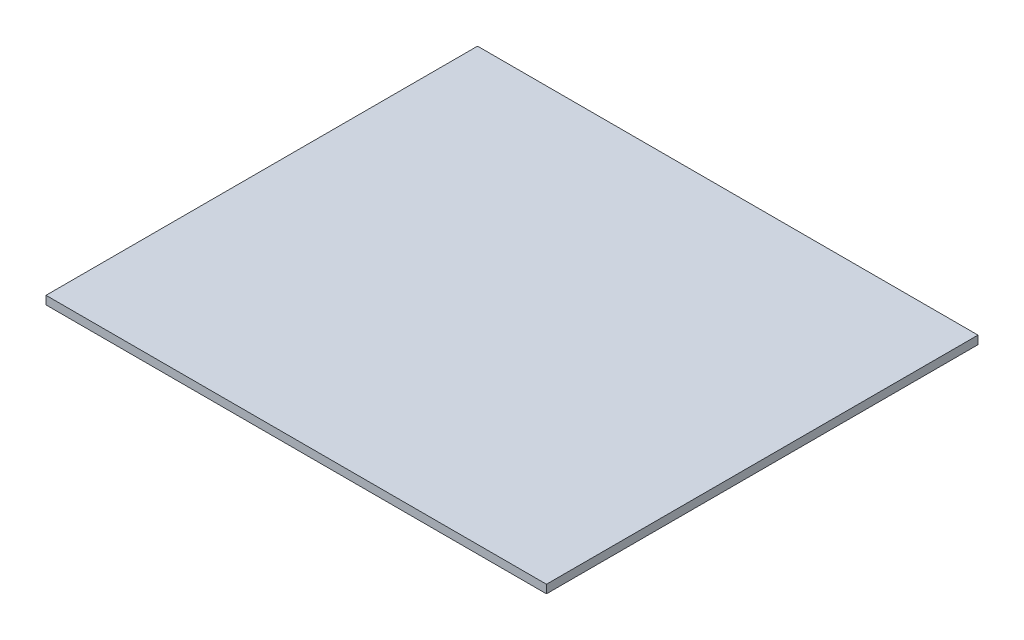
ISO-10303-21;
HEADER;
FILE_DESCRIPTION(('STEP AP214'),'2;1');
FILE_NAME('part.step','',(''),(''),'','','');
FILE_SCHEMA(('AUTOMOTIVE_DESIGN { 1 0 10303 214 1 1 1 1 }'));
ENDSEC;
DATA;
#1=APPLICATION_CONTEXT('core data for automotive mechanical design processes');
#2=APPLICATION_PROTOCOL_DEFINITION('international standard','automotive_design',2000,#1);
#3=PRODUCT_CONTEXT('',#1,'mechanical');
#4=PRODUCT('Part','Part','',(#3));
#5=PRODUCT_RELATED_PRODUCT_CATEGORY('part','',(#4));
#6=PRODUCT_DEFINITION_FORMATION('','',#4);
#7=PRODUCT_DEFINITION_CONTEXT('part definition',#1,'design');
#8=PRODUCT_DEFINITION('design','',#6,#7);
#9=PRODUCT_DEFINITION_SHAPE('','',#8);
#10=(LENGTH_UNIT() NAMED_UNIT(*) SI_UNIT(.MILLI.,.METRE.));
#11=(NAMED_UNIT(*) PLANE_ANGLE_UNIT() SI_UNIT($,.RADIAN.));
#12=(NAMED_UNIT(*) SI_UNIT($,.STERADIAN.) SOLID_ANGLE_UNIT());
#13=UNCERTAINTY_MEASURE_WITH_UNIT(LENGTH_MEASURE(1.E-05),#10,'distance_accuracy_value','');
#14=(GEOMETRIC_REPRESENTATION_CONTEXT(3) GLOBAL_UNCERTAINTY_ASSIGNED_CONTEXT((#13)) GLOBAL_UNIT_ASSIGNED_CONTEXT((#10,
#11,#12)) REPRESENTATION_CONTEXT('',''));
#15=CARTESIAN_POINT('',(0.,0.,0.));
#16=DIRECTION('',(0.,0.,1.));
#17=DIRECTION('',(1.,0.,0.));
#18=AXIS2_PLACEMENT_3D('',#15,#16,#17);
#19=CARTESIAN_POINT('',(500.,10.,0.));
#20=DIRECTION('',(-1.,0.,0.));
#21=DIRECTION('',(0.,0.,1.));
#22=AXIS2_PLACEMENT_3D('',#19,#20,#21);
#23=PLANE('',#22);
#24=DIRECTION('',(0.,0.,-1.));
#25=VECTOR('',#24,1.);
#26=CARTESIAN_POINT('',(500.,0.,0.));
#27=LINE('',#26,#25);
#28=CARTESIAN_POINT('',(500.,0.,0.));
#29=VERTEX_POINT('',#28);
#30=CARTESIAN_POINT('',(500.,0.,-517.37));
#31=VERTEX_POINT('',#30);
#32=EDGE_CURVE('E95',#29,#31,#27,.T.);
#33=ORIENTED_EDGE('',*,*,#32,.T.);
#34=DIRECTION('',(0.,-1.,0.));
#35=VECTOR('',#34,1.);
#36=CARTESIAN_POINT('',(500.,10.,-517.37));
#37=LINE('',#36,#35);
#38=CARTESIAN_POINT('',(500.,10.,-517.37));
#39=VERTEX_POINT('',#38);
#40=EDGE_CURVE('E11',#39,#31,#37,.T.);
#41=ORIENTED_EDGE('',*,*,#40,.F.);
#42=DIRECTION('',(0.,0.,-1.));
#43=VECTOR('',#42,1.);
#44=CARTESIAN_POINT('',(500.,10.,0.));
#45=LINE('',#44,#43);
#46=CARTESIAN_POINT('',(500.,10.,0.));
#47=VERTEX_POINT('',#46);
#48=EDGE_CURVE('E80',#47,#39,#45,.T.);
#49=ORIENTED_EDGE('',*,*,#48,.F.);
#50=DIRECTION('',(0.,-1.,0.));
#51=VECTOR('',#50,1.);
#52=CARTESIAN_POINT('',(500.,10.,0.));
#53=LINE('',#52,#51);
#54=EDGE_CURVE('E91',#47,#29,#53,.T.);
#55=ORIENTED_EDGE('',*,*,#54,.T.);
#56=EDGE_LOOP('',(#33,#41,#49,#55));
#57=FACE_BOUND('',#56,.T.);
#58=ADVANCED_FACE('F33',(#57),#23,.F.);
#59=CARTESIAN_POINT('',(0.,10.,-517.37));
#60=DIRECTION('',(0.,0.,1.));
#61=DIRECTION('',(1.,0.,0.));
#62=AXIS2_PLACEMENT_3D('',#59,#60,#61);
#63=PLANE('',#62);
#64=DIRECTION('',(-1.,0.,0.));
#65=VECTOR('',#64,1.);
#66=CARTESIAN_POINT('',(0.,0.,-517.37));
#67=LINE('',#66,#65);
#68=CARTESIAN_POINT('',(-100.,0.,-517.37));
#69=VERTEX_POINT('',#68);
#70=EDGE_CURVE('E85',#31,#69,#67,.T.);
#71=ORIENTED_EDGE('',*,*,#70,.T.);
#72=DIRECTION('',(0.,-1.,0.));
#73=VECTOR('',#72,1.);
#74=CARTESIAN_POINT('',(-100.,10.,-517.37));
#75=LINE('',#74,#73);
#76=CARTESIAN_POINT('',(-100.,10.,-517.37));
#77=VERTEX_POINT('',#76);
#78=EDGE_CURVE('E41',#77,#69,#75,.T.);
#79=ORIENTED_EDGE('',*,*,#78,.F.);
#80=DIRECTION('',(-1.,0.,0.));
#81=VECTOR('',#80,1.);
#82=CARTESIAN_POINT('',(0.,10.,-517.37));
#83=LINE('',#82,#81);
#84=EDGE_CURVE('E75',#39,#77,#83,.T.);
#85=ORIENTED_EDGE('',*,*,#84,.F.);
#86=ORIENTED_EDGE('',*,*,#40,.T.);
#87=EDGE_LOOP('',(#71,#79,#85,#86));
#88=FACE_BOUND('',#87,.T.);
#89=ADVANCED_FACE('F84',(#88),#63,.F.);
#90=CARTESIAN_POINT('',(-100.,10.,0.));
#91=DIRECTION('',(-1.,0.,0.));
#92=DIRECTION('',(0.,0.,1.));
#93=AXIS2_PLACEMENT_3D('',#90,#91,#92);
#94=PLANE('',#93);
#95=DIRECTION('',(0.,0.,-1.));
#96=VECTOR('',#95,1.);
#97=CARTESIAN_POINT('',(-100.,0.,0.));
#98=LINE('',#97,#96);
#99=CARTESIAN_POINT('',(-100.,0.,0.));
#100=VERTEX_POINT('',#99);
#101=EDGE_CURVE('E99',#100,#69,#98,.T.);
#102=ORIENTED_EDGE('',*,*,#101,.F.);
#103=DIRECTION('',(0.,-1.,0.));
#104=VECTOR('',#103,1.);
#105=CARTESIAN_POINT('',(-100.,10.,0.));
#106=LINE('',#105,#104);
#107=CARTESIAN_POINT('',(-100.,10.,0.));
#108=VERTEX_POINT('',#107);
#109=EDGE_CURVE('E65',#108,#100,#106,.T.);
#110=ORIENTED_EDGE('',*,*,#109,.F.);
#111=DIRECTION('',(0.,0.,-1.));
#112=VECTOR('',#111,1.);
#113=CARTESIAN_POINT('',(-100.,10.,0.));
#114=LINE('',#113,#112);
#115=EDGE_CURVE('E78',#108,#77,#114,.T.);
#116=ORIENTED_EDGE('',*,*,#115,.T.);
#117=ORIENTED_EDGE('',*,*,#78,.T.);
#118=EDGE_LOOP('',(#102,#110,#116,#117));
#119=FACE_BOUND('',#118,.T.);
#120=ADVANCED_FACE('F89',(#119),#94,.T.);
#121=CARTESIAN_POINT('',(0.,10.,0.));
#122=DIRECTION('',(0.,0.,-1.));
#123=DIRECTION('',(-1.,0.,0.));
#124=AXIS2_PLACEMENT_3D('',#121,#122,#123);
#125=PLANE('',#124);
#126=DIRECTION('',(1.,0.,0.));
#127=VECTOR('',#126,1.);
#128=CARTESIAN_POINT('',(0.,0.,0.));
#129=LINE('',#128,#127);
#130=EDGE_CURVE('E68',#100,#29,#129,.T.);
#131=ORIENTED_EDGE('',*,*,#130,.T.);
#132=ORIENTED_EDGE('',*,*,#54,.F.);
#133=DIRECTION('',(1.,0.,0.));
#134=VECTOR('',#133,1.);
#135=CARTESIAN_POINT('',(0.,10.,0.));
#136=LINE('',#135,#134);
#137=EDGE_CURVE('E49',#108,#47,#136,.T.);
#138=ORIENTED_EDGE('',*,*,#137,.F.);
#139=ORIENTED_EDGE('',*,*,#109,.T.);
#140=EDGE_LOOP('',(#131,#132,#138,#139));
#141=FACE_BOUND('',#140,.T.);
#142=ADVANCED_FACE('F112',(#141),#125,.F.);
#143=CARTESIAN_POINT('',(0.,10.,0.));
#144=DIRECTION('',(0.,1.,0.));
#145=DIRECTION('',(0.,0.,1.));
#146=AXIS2_PLACEMENT_3D('',#143,#144,#145);
#147=PLANE('',#146);
#148=ORIENTED_EDGE('',*,*,#48,.T.);
#149=ORIENTED_EDGE('',*,*,#84,.T.);
#150=ORIENTED_EDGE('',*,*,#115,.F.);
#151=ORIENTED_EDGE('',*,*,#137,.T.);
#152=EDGE_LOOP('',(#148,#149,#150,#151));
#153=FACE_BOUND('',#152,.T.);
#154=ADVANCED_FACE('F76',(#153),#147,.T.);
#155=CARTESIAN_POINT('',(0.,0.,0.));
#156=DIRECTION('',(0.,1.,0.));
#157=DIRECTION('',(0.,0.,1.));
#158=AXIS2_PLACEMENT_3D('',#155,#156,#157);
#159=PLANE('',#158);
#160=ORIENTED_EDGE('',*,*,#32,.F.);
#161=ORIENTED_EDGE('',*,*,#130,.F.);
#162=ORIENTED_EDGE('',*,*,#101,.T.);
#163=ORIENTED_EDGE('',*,*,#70,.F.);
#164=EDGE_LOOP('',(#160,#161,#162,#163));
#165=FACE_BOUND('',#164,.T.);
#166=ADVANCED_FACE('F106',(#165),#159,.F.);
#167=CLOSED_SHELL('',(#58,#89,#120,#142,#154,#166));
#168=MANIFOLD_SOLID_BREP('B2',#167);
#169=ADVANCED_BREP_SHAPE_REPRESENTATION('',(#18,#168),#14);
#170=SHAPE_DEFINITION_REPRESENTATION(#9,#169);
ENDSEC;
END-ISO-10303-21;
